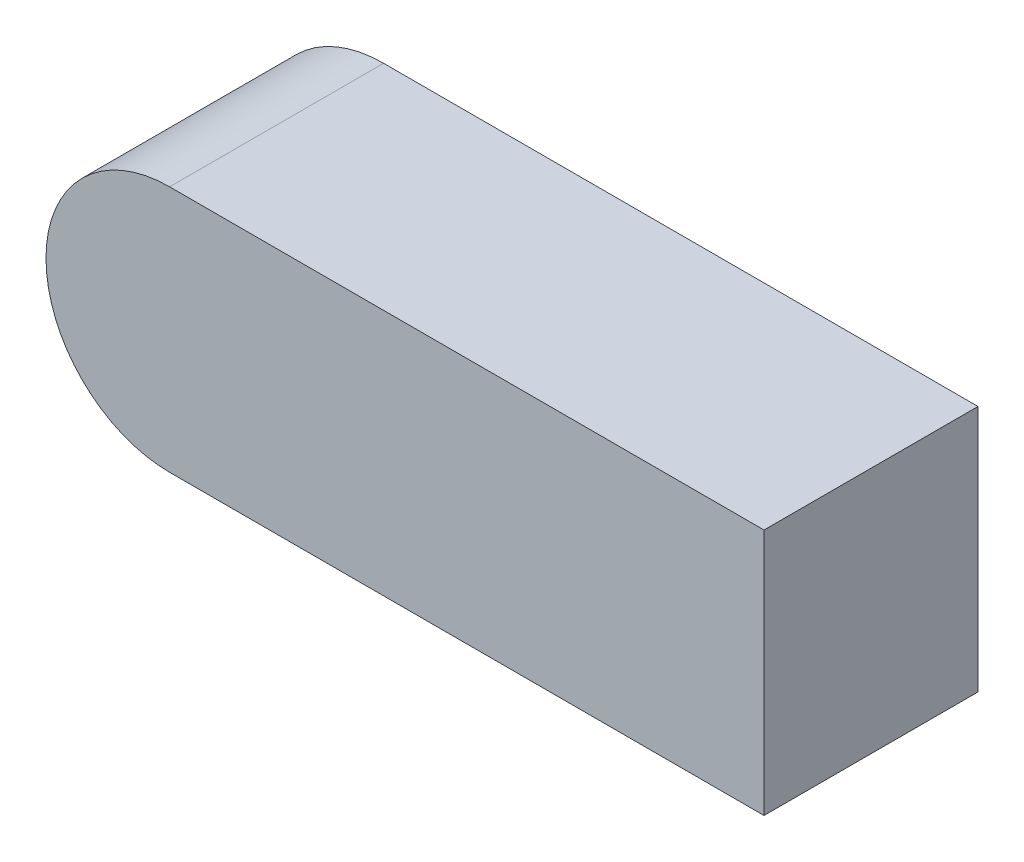
ISO-10303-21;
HEADER;
FILE_DESCRIPTION(('STEP AP214'),'2;1');
FILE_NAME('part.step','',(''),(''),'','','');
FILE_SCHEMA(('AUTOMOTIVE_DESIGN { 1 0 10303 214 1 1 1 1 }'));
ENDSEC;
DATA;
#1=APPLICATION_CONTEXT('core data for automotive mechanical design processes');
#2=APPLICATION_PROTOCOL_DEFINITION('international standard','automotive_design',2000,#1);
#3=PRODUCT_CONTEXT('',#1,'mechanical');
#4=PRODUCT('Part','Part','',(#3));
#5=PRODUCT_RELATED_PRODUCT_CATEGORY('part','',(#4));
#6=PRODUCT_DEFINITION_FORMATION('','',#4);
#7=PRODUCT_DEFINITION_CONTEXT('part definition',#1,'design');
#8=PRODUCT_DEFINITION('design','',#6,#7);
#9=PRODUCT_DEFINITION_SHAPE('','',#8);
#10=(LENGTH_UNIT() NAMED_UNIT(*) SI_UNIT(.MILLI.,.METRE.));
#11=(NAMED_UNIT(*) PLANE_ANGLE_UNIT() SI_UNIT($,.RADIAN.));
#12=(NAMED_UNIT(*) SI_UNIT($,.STERADIAN.) SOLID_ANGLE_UNIT());
#13=UNCERTAINTY_MEASURE_WITH_UNIT(LENGTH_MEASURE(1.E-05),#10,'distance_accuracy_value','');
#14=(GEOMETRIC_REPRESENTATION_CONTEXT(3) GLOBAL_UNCERTAINTY_ASSIGNED_CONTEXT((#13)) GLOBAL_UNIT_ASSIGNED_CONTEXT((#10,
#11,#12)) REPRESENTATION_CONTEXT('',''));
#15=CARTESIAN_POINT('',(0.,0.,0.));
#16=DIRECTION('',(0.,0.,1.));
#17=DIRECTION('',(1.,0.,0.));
#18=AXIS2_PLACEMENT_3D('',#15,#16,#17);
#19=CARTESIAN_POINT('',(62.5,-26.,-22.5));
#20=DIRECTION('',(0.,0.,1.));
#21=DIRECTION('',(1.,0.,0.));
#22=AXIS2_PLACEMENT_3D('',#19,#20,#21);
#23=PLANE('',#22);
#24=DIRECTION('',(-1.,0.,0.));
#25=VECTOR('',#24,1.);
#26=CARTESIAN_POINT('',(62.5,-26.,-22.5));
#27=LINE('',#26,#25);
#28=CARTESIAN_POINT('',(62.5,-26.,-22.5));
#29=VERTEX_POINT('',#28);
#30=CARTESIAN_POINT('',(-62.5,-26.,-22.5));
#31=VERTEX_POINT('',#30);
#32=EDGE_CURVE('E85',#29,#31,#27,.T.);
#33=ORIENTED_EDGE('',*,*,#32,.T.);
#34=CARTESIAN_POINT('',(-62.5,0.,-22.5));
#35=DIRECTION('',(0.,0.,-1.));
#36=DIRECTION('',(-1.,0.,0.));
#37=AXIS2_PLACEMENT_3D('',#34,#35,#36);
#38=CIRCLE('',#37,26.);
#39=CARTESIAN_POINT('',(-62.5,26.,-22.5));
#40=VERTEX_POINT('',#39);
#41=EDGE_CURVE('E72',#31,#40,#38,.T.);
#42=ORIENTED_EDGE('',*,*,#41,.T.);
#43=DIRECTION('',(-1.,0.,0.));
#44=VECTOR('',#43,1.);
#45=CARTESIAN_POINT('',(62.5,26.,-22.5));
#46=LINE('',#45,#44);
#47=CARTESIAN_POINT('',(62.5,26.,-22.5));
#48=VERTEX_POINT('',#47);
#49=EDGE_CURVE('E11',#48,#40,#46,.T.);
#50=ORIENTED_EDGE('',*,*,#49,.F.);
#51=DIRECTION('',(0.,1.,0.));
#52=VECTOR('',#51,1.);
#53=CARTESIAN_POINT('',(62.5,-26.,-22.5));
#54=LINE('',#53,#52);
#55=EDGE_CURVE('E91',#29,#48,#54,.T.);
#56=ORIENTED_EDGE('',*,*,#55,.F.);
#57=EDGE_LOOP('',(#33,#42,#50,#56));
#58=FACE_BOUND('',#57,.T.);
#59=ADVANCED_FACE('F33',(#58),#23,.F.);
#60=CARTESIAN_POINT('',(62.5,26.,22.5));
#61=DIRECTION('',(0.,-1.,0.));
#62=DIRECTION('',(0.,0.,-1.));
#63=AXIS2_PLACEMENT_3D('',#60,#61,#62);
#64=PLANE('',#63);
#65=DIRECTION('',(0.,0.,1.));
#66=VECTOR('',#65,1.);
#67=CARTESIAN_POINT('',(-62.5,26.,22.5));
#68=LINE('',#67,#66);
#69=CARTESIAN_POINT('',(-62.5,26.,22.5));
#70=VERTEX_POINT('',#69);
#71=EDGE_CURVE('E68',#40,#70,#68,.T.);
#72=ORIENTED_EDGE('',*,*,#71,.T.);
#73=DIRECTION('',(-1.,0.,0.));
#74=VECTOR('',#73,1.);
#75=CARTESIAN_POINT('',(62.5,26.,22.5));
#76=LINE('',#75,#74);
#77=CARTESIAN_POINT('',(62.5,26.,22.5));
#78=VERTEX_POINT('',#77);
#79=EDGE_CURVE('E41',#78,#70,#76,.T.);
#80=ORIENTED_EDGE('',*,*,#79,.F.);
#81=DIRECTION('',(0.,0.,1.));
#82=VECTOR('',#81,1.);
#83=CARTESIAN_POINT('',(62.5,26.,22.5));
#84=LINE('',#83,#82);
#85=EDGE_CURVE('E88',#48,#78,#84,.T.);
#86=ORIENTED_EDGE('',*,*,#85,.F.);
#87=ORIENTED_EDGE('',*,*,#49,.T.);
#88=EDGE_LOOP('',(#72,#80,#86,#87));
#89=FACE_BOUND('',#88,.T.);
#90=ADVANCED_FACE('F87',(#89),#64,.F.);
#91=CARTESIAN_POINT('',(62.5,-26.,22.5));
#92=DIRECTION('',(0.,0.,-1.));
#93=DIRECTION('',(-1.,0.,0.));
#94=AXIS2_PLACEMENT_3D('',#91,#92,#93);
#95=PLANE('',#94);
#96=ORIENTED_EDGE('',*,*,#79,.T.);
#97=CARTESIAN_POINT('',(-62.5,0.,22.5));
#98=DIRECTION('',(0.,0.,-1.));
#99=DIRECTION('',(-1.,0.,0.));
#100=AXIS2_PLACEMENT_3D('',#97,#98,#99);
#101=CIRCLE('',#100,26.);
#102=CARTESIAN_POINT('',(-62.5,-26.,22.5));
#103=VERTEX_POINT('',#102);
#104=EDGE_CURVE('E75',#70,#103,#101,.F.);
#105=ORIENTED_EDGE('',*,*,#104,.T.);
#106=DIRECTION('',(-1.,0.,0.));
#107=VECTOR('',#106,1.);
#108=CARTESIAN_POINT('',(62.5,-26.,22.5));
#109=LINE('',#108,#107);
#110=CARTESIAN_POINT('',(62.5,-26.,22.5));
#111=VERTEX_POINT('',#110);
#112=EDGE_CURVE('E101',#111,#103,#109,.T.);
#113=ORIENTED_EDGE('',*,*,#112,.F.);
#114=DIRECTION('',(0.,-1.,0.));
#115=VECTOR('',#114,1.);
#116=CARTESIAN_POINT('',(62.5,-26.,22.5));
#117=LINE('',#116,#115);
#118=EDGE_CURVE('E90',#78,#111,#117,.T.);
#119=ORIENTED_EDGE('',*,*,#118,.F.);
#120=EDGE_LOOP('',(#96,#105,#113,#119));
#121=FACE_BOUND('',#120,.T.);
#122=ADVANCED_FACE('F104',(#121),#95,.F.);
#123=CARTESIAN_POINT('',(62.5,-26.,22.5));
#124=DIRECTION('',(0.,1.,0.));
#125=DIRECTION('',(0.,0.,1.));
#126=AXIS2_PLACEMENT_3D('',#123,#124,#125);
#127=PLANE('',#126);
#128=DIRECTION('',(0.,0.,-1.));
#129=VECTOR('',#128,1.);
#130=CARTESIAN_POINT('',(-62.5,-26.,22.5));
#131=LINE('',#130,#129);
#132=EDGE_CURVE('E79',#103,#31,#131,.T.);
#133=ORIENTED_EDGE('',*,*,#132,.T.);
#134=ORIENTED_EDGE('',*,*,#32,.F.);
#135=DIRECTION('',(0.,0.,-1.));
#136=VECTOR('',#135,1.);
#137=CARTESIAN_POINT('',(62.5,-26.,22.5));
#138=LINE('',#137,#136);
#139=EDGE_CURVE('E48',#111,#29,#138,.T.);
#140=ORIENTED_EDGE('',*,*,#139,.F.);
#141=ORIENTED_EDGE('',*,*,#112,.T.);
#142=EDGE_LOOP('',(#133,#134,#140,#141));
#143=FACE_BOUND('',#142,.T.);
#144=ADVANCED_FACE('F107',(#143),#127,.F.);
#145=CARTESIAN_POINT('',(62.5,0.,0.));
#146=DIRECTION('',(-1.,0.,0.));
#147=DIRECTION('',(0.,0.,1.));
#148=AXIS2_PLACEMENT_3D('',#145,#146,#147);
#149=PLANE('',#148);
#150=ORIENTED_EDGE('',*,*,#55,.T.);
#151=ORIENTED_EDGE('',*,*,#85,.T.);
#152=ORIENTED_EDGE('',*,*,#118,.T.);
#153=ORIENTED_EDGE('',*,*,#139,.T.);
#154=EDGE_LOOP('',(#150,#151,#152,#153));
#155=FACE_BOUND('',#154,.T.);
#156=ADVANCED_FACE('F93',(#155),#149,.F.);
#157=CARTESIAN_POINT('',(-62.5,0.,80.6377674149945));
#158=DIRECTION('',(0.,0.,-1.));
#159=DIRECTION('',(-1.,0.,0.));
#160=AXIS2_PLACEMENT_3D('',#157,#158,#159);
#161=CYLINDRICAL_SURFACE('',#160,26.);
#162=ORIENTED_EDGE('',*,*,#104,.F.);
#163=ORIENTED_EDGE('',*,*,#71,.F.);
#164=ORIENTED_EDGE('',*,*,#41,.F.);
#165=ORIENTED_EDGE('',*,*,#132,.F.);
#166=EDGE_LOOP('',(#162,#163,#164,#165));
#167=FACE_BOUND('',#166,.T.);
#168=ADVANCED_FACE('F70',(#167),#161,.T.);
#169=CLOSED_SHELL('',(#59,#90,#122,#144,#156,#168));
#170=MANIFOLD_SOLID_BREP('B2',#169);
#171=ADVANCED_BREP_SHAPE_REPRESENTATION('',(#18,#170),#14);
#172=SHAPE_DEFINITION_REPRESENTATION(#9,#171);
ENDSEC;
END-ISO-10303-21;
